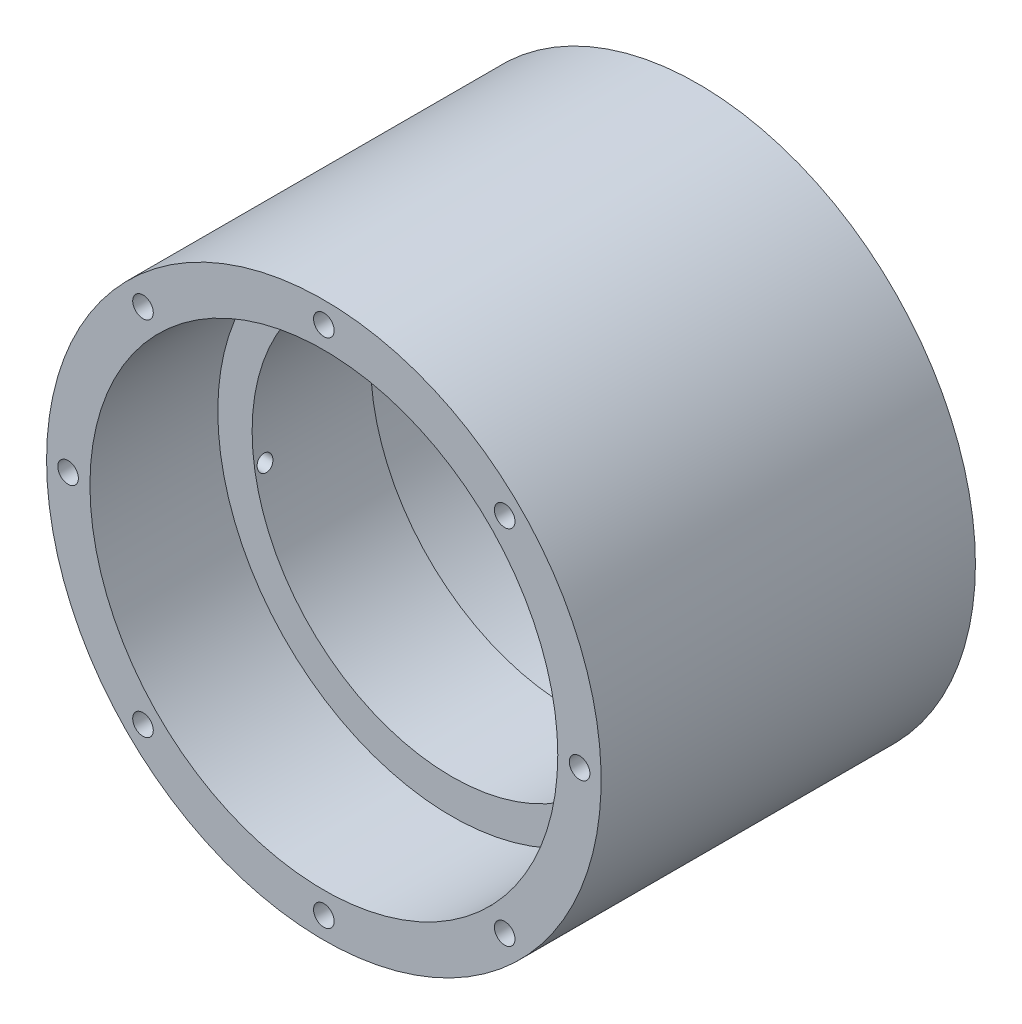
ISO-10303-21;
HEADER;
FILE_DESCRIPTION(('STEP AP214'),'2;1');
FILE_NAME('part.step','',(''),(''),'','','');
FILE_SCHEMA(('AUTOMOTIVE_DESIGN { 1 0 10303 214 1 1 1 1 }'));
ENDSEC;
DATA;
#1=APPLICATION_CONTEXT('core data for automotive mechanical design processes');
#2=APPLICATION_PROTOCOL_DEFINITION('international standard','automotive_design',2000,#1);
#3=PRODUCT_CONTEXT('',#1,'mechanical');
#4=PRODUCT('Part','Part','',(#3));
#5=PRODUCT_RELATED_PRODUCT_CATEGORY('part','',(#4));
#6=PRODUCT_DEFINITION_FORMATION('','',#4);
#7=PRODUCT_DEFINITION_CONTEXT('part definition',#1,'design');
#8=PRODUCT_DEFINITION('design','',#6,#7);
#9=PRODUCT_DEFINITION_SHAPE('','',#8);
#10=(LENGTH_UNIT() NAMED_UNIT(*) SI_UNIT(.MILLI.,.METRE.));
#11=(NAMED_UNIT(*) PLANE_ANGLE_UNIT() SI_UNIT($,.RADIAN.));
#12=(NAMED_UNIT(*) SI_UNIT($,.STERADIAN.) SOLID_ANGLE_UNIT());
#13=UNCERTAINTY_MEASURE_WITH_UNIT(LENGTH_MEASURE(1.E-05),#10,'distance_accuracy_value','');
#14=(GEOMETRIC_REPRESENTATION_CONTEXT(3) GLOBAL_UNCERTAINTY_ASSIGNED_CONTEXT((#13)) GLOBAL_UNIT_ASSIGNED_CONTEXT((#10,
#11,#12)) REPRESENTATION_CONTEXT('',''));
#15=CARTESIAN_POINT('',(0.,0.,0.));
#16=DIRECTION('',(0.,0.,1.));
#17=DIRECTION('',(1.,0.,0.));
#18=AXIS2_PLACEMENT_3D('',#15,#16,#17);
#19=CARTESIAN_POINT('',(0.,0.,60.));
#20=DIRECTION('',(0.,0.,-1.));
#21=DIRECTION('',(-1.,0.,0.));
#22=AXIS2_PLACEMENT_3D('',#19,#20,#21);
#23=CYLINDRICAL_SURFACE('',#22,44.45);
#24=DIRECTION('',(0.,0.,-1.));
#25=VECTOR('',#24,1.);
#26=CARTESIAN_POINT('',(-43.7241637998945,-7.99999999999999,50.));
#27=LINE('',#26,#25);
#28=CARTESIAN_POINT('',(-43.7241637998945,-7.99999999999999,50.));
#29=VERTEX_POINT('',#28);
#30=CARTESIAN_POINT('',(-43.7241637998945,-7.99999999999999,0.));
#31=VERTEX_POINT('',#30);
#32=EDGE_CURVE('E52',#29,#31,#27,.T.);
#33=ORIENTED_EDGE('',*,*,#32,.T.);
#34=CARTESIAN_POINT('',(0.,0.,0.));
#35=DIRECTION('',(0.,0.,-1.));
#36=DIRECTION('',(-1.,0.,0.));
#37=AXIS2_PLACEMENT_3D('',#34,#35,#36);
#38=CIRCLE('',#37,44.45);
#39=CARTESIAN_POINT('',(-43.7241637998945,7.99999999999994,0.));
#40=VERTEX_POINT('',#39);
#41=EDGE_CURVE('E39',#40,#31,#38,.T.);
#42=ORIENTED_EDGE('',*,*,#41,.F.);
#43=DIRECTION('',(0.,0.,-1.));
#44=VECTOR('',#43,1.);
#45=CARTESIAN_POINT('',(-43.7241637998945,7.99999999999998,50.));
#46=LINE('',#45,#44);
#47=CARTESIAN_POINT('',(-43.7241637998945,7.99999999999998,50.));
#48=VERTEX_POINT('',#47);
#49=EDGE_CURVE('E46',#48,#40,#46,.T.);
#50=ORIENTED_EDGE('',*,*,#49,.F.);
#51=CARTESIAN_POINT('',(0.,0.,50.));
#52=DIRECTION('',(0.,0.,-1.));
#53=DIRECTION('',(-1.,0.,0.));
#54=AXIS2_PLACEMENT_3D('',#51,#52,#53);
#55=CIRCLE('',#54,44.45);
#56=EDGE_CURVE('E62',#29,#48,#55,.T.);
#57=ORIENTED_EDGE('',*,*,#56,.F.);
#58=EDGE_LOOP('',(#33,#42,#50,#57));
#59=FACE_BOUND('',#58,.T.);
#60=CARTESIAN_POINT('',(0.,0.,60.));
#61=DIRECTION('',(0.,0.,-1.));
#62=DIRECTION('',(-1.,0.,0.));
#63=AXIS2_PLACEMENT_3D('',#60,#61,#62);
#64=CIRCLE('',#63,44.45);
#65=CARTESIAN_POINT('',(-44.45,0.,60.));
#66=VERTEX_POINT('',#65);
#67=EDGE_CURVE('E11',#66,#66,#64,.T.);
#68=ORIENTED_EDGE('',*,*,#67,.T.);
#69=EDGE_LOOP('',(#68));
#70=FACE_BOUND('',#69,.T.);
#71=ADVANCED_FACE('F32',(#59,#70),#23,.T.);
#72=CARTESIAN_POINT('',(44.45,0.,60.));
#73=DIRECTION('',(0.,0.,1.));
#74=DIRECTION('',(1.,0.,0.));
#75=AXIS2_PLACEMENT_3D('',#72,#73,#74);
#76=PLANE('',#75);
#77=CARTESIAN_POINT('',(28.9913780286488,28.9913780286481,60.));
#78=DIRECTION('',(0.,0.,1.));
#79=DIRECTION('',(1.,0.,0.));
#80=AXIS2_PLACEMENT_3D('',#77,#78,#79);
#81=CIRCLE('',#80,1.64999999999998);
#82=CARTESIAN_POINT('',(30.6413780286488,28.9913780286481,60.));
#83=VERTEX_POINT('',#82);
#84=EDGE_CURVE('E137',#83,#83,#81,.T.);
#85=ORIENTED_EDGE('',*,*,#84,.F.);
#86=EDGE_LOOP('',(#85));
#87=FACE_BOUND('',#86,.T.);
#88=CARTESIAN_POINT('',(4.29452204677705E-13,41.,60.));
#89=DIRECTION('',(0.,0.,1.));
#90=DIRECTION('',(1.,0.,0.));
#91=AXIS2_PLACEMENT_3D('',#88,#89,#90);
#92=CIRCLE('',#91,1.64999999999998);
#93=CARTESIAN_POINT('',(1.65000000000041,41.,60.));
#94=VERTEX_POINT('',#93);
#95=EDGE_CURVE('E131',#94,#94,#92,.T.);
#96=ORIENTED_EDGE('',*,*,#95,.F.);
#97=EDGE_LOOP('',(#96));
#98=FACE_BOUND('',#97,.T.);
#99=CARTESIAN_POINT('',(-28.9913780286482,28.9913780286487,60.));
#100=DIRECTION('',(0.,0.,1.));
#101=DIRECTION('',(1.,0.,0.));
#102=AXIS2_PLACEMENT_3D('',#99,#100,#101);
#103=CIRCLE('',#102,1.64999999999998);
#104=CARTESIAN_POINT('',(-27.3413780286482,28.9913780286487,60.));
#105=VERTEX_POINT('',#104);
#106=EDGE_CURVE('E125',#105,#105,#103,.T.);
#107=ORIENTED_EDGE('',*,*,#106,.F.);
#108=EDGE_LOOP('',(#107));
#109=FACE_BOUND('',#108,.T.);
#110=CARTESIAN_POINT('',(-41.,2.86301469785137E-13,60.));
#111=DIRECTION('',(0.,0.,1.));
#112=DIRECTION('',(1.,0.,0.));
#113=AXIS2_PLACEMENT_3D('',#110,#111,#112);
#114=CIRCLE('',#113,1.64999999999998);
#115=CARTESIAN_POINT('',(-39.35,2.86301469785137E-13,60.));
#116=VERTEX_POINT('',#115);
#117=EDGE_CURVE('E119',#116,#116,#114,.T.);
#118=ORIENTED_EDGE('',*,*,#117,.F.);
#119=EDGE_LOOP('',(#118));
#120=FACE_BOUND('',#119,.T.);
#121=CARTESIAN_POINT('',(-28.9913780286486,-28.9913780286483,60.));
#122=DIRECTION('',(0.,0.,1.));
#123=DIRECTION('',(1.,0.,0.));
#124=AXIS2_PLACEMENT_3D('',#121,#122,#123);
#125=CIRCLE('',#124,1.64999999999998);
#126=CARTESIAN_POINT('',(-27.3413780286486,-28.9913780286483,60.));
#127=VERTEX_POINT('',#126);
#128=EDGE_CURVE('E113',#127,#127,#125,.T.);
#129=ORIENTED_EDGE('',*,*,#128,.F.);
#130=EDGE_LOOP('',(#129));
#131=FACE_BOUND('',#130,.T.);
#132=CARTESIAN_POINT('',(-1.43150734892569E-13,-41.,60.));
#133=DIRECTION('',(0.,0.,1.));
#134=DIRECTION('',(1.,0.,0.));
#135=AXIS2_PLACEMENT_3D('',#132,#133,#134);
#136=CIRCLE('',#135,1.64999999999998);
#137=CARTESIAN_POINT('',(1.64999999999984,-41.,60.));
#138=VERTEX_POINT('',#137);
#139=EDGE_CURVE('E107',#138,#138,#136,.T.);
#140=ORIENTED_EDGE('',*,*,#139,.F.);
#141=EDGE_LOOP('',(#140));
#142=FACE_BOUND('',#141,.T.);
#143=CARTESIAN_POINT('',(28.9913780286484,-28.9913780286485,60.));
#144=DIRECTION('',(0.,0.,1.));
#145=DIRECTION('',(1.,0.,0.));
#146=AXIS2_PLACEMENT_3D('',#143,#144,#145);
#147=CIRCLE('',#146,1.64999999999998);
#148=CARTESIAN_POINT('',(30.6413780286484,-28.9913780286485,60.));
#149=VERTEX_POINT('',#148);
#150=EDGE_CURVE('E101',#149,#149,#147,.T.);
#151=ORIENTED_EDGE('',*,*,#150,.F.);
#152=EDGE_LOOP('',(#151));
#153=FACE_BOUND('',#152,.T.);
#154=CARTESIAN_POINT('',(41.,0.,60.));
#155=DIRECTION('',(0.,0.,1.));
#156=DIRECTION('',(1.,0.,0.));
#157=AXIS2_PLACEMENT_3D('',#154,#155,#156);
#158=CIRCLE('',#157,1.64999999999998);
#159=CARTESIAN_POINT('',(42.65,0.,60.));
#160=VERTEX_POINT('',#159);
#161=EDGE_CURVE('E95',#160,#160,#158,.T.);
#162=ORIENTED_EDGE('',*,*,#161,.F.);
#163=EDGE_LOOP('',(#162));
#164=FACE_BOUND('',#163,.T.);
#165=CARTESIAN_POINT('',(0.,0.,60.));
#166=DIRECTION('',(0.,0.,-1.));
#167=DIRECTION('',(-1.,0.,0.));
#168=AXIS2_PLACEMENT_3D('',#165,#166,#167);
#169=CIRCLE('',#168,37.5);
#170=CARTESIAN_POINT('',(-37.5,0.,60.));
#171=VERTEX_POINT('',#170);
#172=EDGE_CURVE('E63',#171,#171,#169,.T.);
#173=ORIENTED_EDGE('',*,*,#172,.T.);
#174=EDGE_LOOP('',(#173));
#175=FACE_BOUND('',#174,.T.);
#176=ORIENTED_EDGE('',*,*,#67,.F.);
#177=EDGE_LOOP('',(#176));
#178=FACE_BOUND('',#177,.T.);
#179=ADVANCED_FACE('F187',(#87,#98,#109,#120,#131,#142,#153,#164,#175,#178),#76,.T.);
#180=CARTESIAN_POINT('',(0.,0.,0.));
#181=DIRECTION('',(0.,0.,-1.));
#182=DIRECTION('',(-1.,0.,0.));
#183=AXIS2_PLACEMENT_3D('',#180,#181,#182);
#184=PLANE('',#183);
#185=CARTESIAN_POINT('',(0.,0.,0.));
#186=DIRECTION('',(0.,0.,-1.));
#187=DIRECTION('',(-1.,0.,0.));
#188=AXIS2_PLACEMENT_3D('',#185,#186,#187);
#189=CIRCLE('',#188,37.5);
#190=CARTESIAN_POINT('',(-37.5,0.,0.));
#191=VERTEX_POINT('',#190);
#192=EDGE_CURVE('E77',#191,#191,#189,.T.);
#193=ORIENTED_EDGE('',*,*,#192,.F.);
#194=EDGE_LOOP('',(#193));
#195=FACE_BOUND('',#194,.T.);
#196=DIRECTION('',(0.,-1.,0.));
#197=VECTOR('',#196,1.);
#198=CARTESIAN_POINT('',(-43.7241637998945,7.99999999999998,0.));
#199=LINE('',#198,#197);
#200=EDGE_CURVE('E57',#40,#31,#199,.T.);
#201=ORIENTED_EDGE('',*,*,#200,.F.);
#202=ORIENTED_EDGE('',*,*,#41,.T.);
#203=EDGE_LOOP('',(#201,#202));
#204=FACE_BOUND('',#203,.T.);
#205=ADVANCED_FACE('F69',(#195,#204),#184,.T.);
#206=CARTESIAN_POINT('',(-43.7241637998945,7.99999999999998,50.));
#207=DIRECTION('',(1.,0.,0.));
#208=DIRECTION('',(0.,1.,0.));
#209=AXIS2_PLACEMENT_3D('',#206,#207,#208);
#210=PLANE('',#209);
#211=CARTESIAN_POINT('',(-43.7241637998945,-5.05000000000007,37.8347480327554));
#212=DIRECTION('',(-1.,0.,0.));
#213=DIRECTION('',(0.,0.,1.));
#214=AXIS2_PLACEMENT_3D('',#211,#212,#213);
#215=CIRCLE('',#214,1.24999999999999);
#216=CARTESIAN_POINT('',(-43.7241637998945,-5.05000000000007,39.0847480327554));
#217=VERTEX_POINT('',#216);
#218=EDGE_CURVE('E168',#217,#217,#215,.T.);
#219=ORIENTED_EDGE('',*,*,#218,.F.);
#220=EDGE_LOOP('',(#219));
#221=FACE_BOUND('',#220,.T.);
#222=CARTESIAN_POINT('',(-43.7241637998945,5.14999999999991,15.5847480327554));
#223=DIRECTION('',(-1.,0.,0.));
#224=DIRECTION('',(0.,0.,1.));
#225=AXIS2_PLACEMENT_3D('',#222,#223,#224);
#226=CIRCLE('',#225,1.24999999999999);
#227=CARTESIAN_POINT('',(-43.7241637998945,5.14999999999991,16.8347480327554));
#228=VERTEX_POINT('',#227);
#229=EDGE_CURVE('E148',#228,#228,#226,.T.);
#230=ORIENTED_EDGE('',*,*,#229,.F.);
#231=EDGE_LOOP('',(#230));
#232=FACE_BOUND('',#231,.T.);
#233=ORIENTED_EDGE('',*,*,#200,.T.);
#234=ORIENTED_EDGE('',*,*,#32,.F.);
#235=DIRECTION('',(0.,-1.,0.));
#236=VECTOR('',#235,1.);
#237=CARTESIAN_POINT('',(-43.7241637998945,7.99999999999998,50.));
#238=LINE('',#237,#236);
#239=EDGE_CURVE('E71',#48,#29,#238,.T.);
#240=ORIENTED_EDGE('',*,*,#239,.F.);
#241=ORIENTED_EDGE('',*,*,#49,.T.);
#242=EDGE_LOOP('',(#233,#234,#240,#241));
#243=FACE_BOUND('',#242,.T.);
#244=ADVANCED_FACE('F58',(#221,#232,#243),#210,.F.);
#245=CARTESIAN_POINT('',(0.,0.,50.));
#246=DIRECTION('',(0.,0.,-1.));
#247=DIRECTION('',(-1.,0.,0.));
#248=AXIS2_PLACEMENT_3D('',#245,#246,#247);
#249=PLANE('',#248);
#250=ORIENTED_EDGE('',*,*,#56,.T.);
#251=ORIENTED_EDGE('',*,*,#239,.T.);
#252=EDGE_LOOP('',(#250,#251));
#253=FACE_BOUND('',#252,.T.);
#254=ADVANCED_FACE('F175',(#253),#249,.T.);
#255=CARTESIAN_POINT('',(0.,0.,60.));
#256=DIRECTION('',(0.,0.,-1.));
#257=DIRECTION('',(-1.,0.,0.));
#258=AXIS2_PLACEMENT_3D('',#255,#256,#257);
#259=CYLINDRICAL_SURFACE('',#258,37.5);
#260=ORIENTED_EDGE('',*,*,#172,.F.);
#261=EDGE_LOOP('',(#260));
#262=FACE_BOUND('',#261,.T.);
#263=CARTESIAN_POINT('',(0.,0.,39.5));
#264=DIRECTION('',(0.,0.,-1.));
#265=DIRECTION('',(-1.,0.,0.));
#266=AXIS2_PLACEMENT_3D('',#263,#264,#265);
#267=CIRCLE('',#266,37.5);
#268=CARTESIAN_POINT('',(-37.5,0.,39.5));
#269=VERTEX_POINT('',#268);
#270=EDGE_CURVE('E89',#269,#269,#267,.T.);
#271=ORIENTED_EDGE('',*,*,#270,.T.);
#272=EDGE_LOOP('',(#271));
#273=FACE_BOUND('',#272,.T.);
#274=ADVANCED_FACE('F184',(#262,#273),#259,.F.);
#275=CARTESIAN_POINT('',(0.,0.,60.));
#276=DIRECTION('',(0.,0.,-1.));
#277=DIRECTION('',(-1.,0.,0.));
#278=AXIS2_PLACEMENT_3D('',#275,#276,#277);
#279=CYLINDRICAL_SURFACE('',#278,37.5);
#280=CARTESIAN_POINT('',(-37.144683334227,5.14999999999991,16.8347480327554));
#281=CARTESIAN_POINT('',(-37.1348528911148,5.22090051073942,16.8347449450375));
#282=CARTESIAN_POINT('',(-37.1248106513063,5.29182459819324,16.8286963232049));
#283=CARTESIAN_POINT('',(-37.1046086195653,5.43166899050378,16.8046693009774));
#284=CARTESIAN_POINT('',(-37.0944486964647,5.50058668172742,16.7866760082665));
#285=CARTESIAN_POINT('',(-37.0743616385239,5.63438406331942,16.7392631093398));
#286=CARTESIAN_POINT('',(-37.0644344074721,5.69926544161951,16.7098483172179));
#287=CARTESIAN_POINT('',(-37.0451732269609,5.82314994177625,16.6404046422333));
#288=CARTESIAN_POINT('',(-37.0358391210029,5.88215461657673,16.6003785737378));
#289=CARTESIAN_POINT('',(-37.0181484620944,5.99247897915528,16.510902512055));
#290=CARTESIAN_POINT('',(-37.0097898163284,6.04381518822893,16.4614733158417));
#291=CARTESIAN_POINT('',(-36.994379464664,6.13743799182848,16.3544997378289));
#292=CARTESIAN_POINT('',(-36.9873277433184,6.17972469331536,16.2969554519593));
#293=CARTESIAN_POINT('',(-36.9749153479508,6.25356115348532,16.1760328728788));
#294=CARTESIAN_POINT('',(-36.9695374310235,6.28522067548756,16.1127233902448));
#295=CARTESIAN_POINT('',(-36.9606212604343,6.33744290485986,15.9815612417574));
#296=CARTESIAN_POINT('',(-36.9570828495687,6.35800656048572,15.9137089646897));
#297=CARTESIAN_POINT('',(-36.9520492466531,6.38719617492573,15.7763487578726));
#298=CARTESIAN_POINT('',(-36.9505277219078,6.39597600407855,15.7068744677431));
#299=CARTESIAN_POINT('',(-36.9495145861352,6.40182641977568,15.5674216524102));
#300=CARTESIAN_POINT('',(-36.9500228646396,6.39889764353856,15.4974431548543));
#301=CARTESIAN_POINT('',(-36.9530336945292,6.38148698474805,15.3594951754045));
#302=CARTESIAN_POINT('',(-36.9555219470029,6.36708793701472,15.2915148995373));
#303=CARTESIAN_POINT('',(-36.9623580246327,6.3272817010028,15.1589581923875));
#304=CARTESIAN_POINT('',(-36.9667058695097,6.30187439598112,15.0943817972114));
#305=CARTESIAN_POINT('',(-36.9770827601659,6.24069803024955,14.970184866816));
#306=CARTESIAN_POINT('',(-36.983118082518,6.20489026534491,14.9105839338025));
#307=CARTESIAN_POINT('',(-36.9965981456411,6.12400209385604,14.798228800226));
#308=CARTESIAN_POINT('',(-37.0040429693984,6.07892114128647,14.745475003106));
#309=CARTESIAN_POINT('',(-37.0201292159303,5.98018050394595,14.6476308799104));
#310=CARTESIAN_POINT('',(-37.0287839028091,5.92642453564731,14.6026399100731));
#311=CARTESIAN_POINT('',(-37.0468765562931,5.81225203153841,14.522300033647));
#312=CARTESIAN_POINT('',(-37.0563145776811,5.75183502978858,14.4869518021697));
#313=CARTESIAN_POINT('',(-37.0757453062318,5.62523391871104,14.4264584466028));
#314=CARTESIAN_POINT('',(-37.0857434329323,5.55898768513162,14.4014450215018));
#315=CARTESIAN_POINT('',(-37.105837369471,5.42324059699343,14.3629388696798));
#316=CARTESIAN_POINT('',(-37.1159331832372,5.35373961112239,14.3494466082008));
#317=CARTESIAN_POINT('',(-37.1359611780551,5.21300936433585,14.3343211631203));
#318=CARTESIAN_POINT('',(-37.1458920406966,5.14177232097843,14.3327584832582));
#319=CARTESIAN_POINT('',(-37.1652413669283,4.99999535897765,14.3417501007413));
#320=CARTESIAN_POINT('',(-37.1746598327812,4.9294554372568,14.3523043445714));
#321=CARTESIAN_POINT('',(-37.1927245810604,4.79125109340386,14.3852338469232));
#322=CARTESIAN_POINT('',(-37.2013725018675,4.72358073868491,14.4075832890255));
#323=CARTESIAN_POINT('',(-37.2177300857738,4.59291914330473,14.4634942945913));
#324=CARTESIAN_POINT('',(-37.2254397815039,4.52992773994223,14.4970554679657));
#325=CARTESIAN_POINT('',(-37.2397305630399,4.41090027827992,14.5741909051058));
#326=CARTESIAN_POINT('',(-37.2463192036033,4.35481842717962,14.617693101265));
#327=CARTESIAN_POINT('',(-37.2583397294966,4.25074937895236,14.713624643073));
#328=CARTESIAN_POINT('',(-37.2637716609072,4.20276185938029,14.7660536329475));
#329=CARTESIAN_POINT('',(-37.2733846739309,4.1166326816723,14.877925374925));
#330=CARTESIAN_POINT('',(-37.2775748230358,4.07841994392651,14.9373126302776));
#331=CARTESIAN_POINT('',(-37.2847278907407,4.0125017603857,15.0617249423557));
#332=CARTESIAN_POINT('',(-37.2876908482523,3.98479598144007,15.1267498202451));
#333=CARTESIAN_POINT('',(-37.2923630418455,3.94083091658892,15.260216685987));
#334=CARTESIAN_POINT('',(-37.294078885748,3.92451131982482,15.3286385808647));
#335=CARTESIAN_POINT('',(-37.2962777184731,3.90356006865423,15.4672682188042));
#336=CARTESIAN_POINT('',(-37.2967607269552,3.89892822786913,15.5374759333703));
#337=CARTESIAN_POINT('',(-37.2964933123858,3.90148533965298,15.6774920819659));
#338=CARTESIAN_POINT('',(-37.2957460548888,3.90864395463081,15.7473010783946));
#339=CARTESIAN_POINT('',(-37.2930256755793,3.93451432165206,15.8847193049675));
#340=CARTESIAN_POINT('',(-37.2910525577753,3.95322603591851,15.9523285423038));
#341=CARTESIAN_POINT('',(-37.285886575909,4.00165607824829,16.0834365931672));
#342=CARTESIAN_POINT('',(-37.282693640832,4.03137504712507,16.1469351671293));
#343=CARTESIAN_POINT('',(-37.2751046064624,4.10095060576332,16.2680278489174));
#344=CARTESIAN_POINT('',(-37.2707085462307,4.14080686640329,16.3256221483487));
#345=CARTESIAN_POINT('',(-37.2607349755815,4.22961286855187,16.433439906076));
#346=CARTESIAN_POINT('',(-37.2551544982269,4.27858540752631,16.4836443077821));
#347=CARTESIAN_POINT('',(-37.2428785516507,4.3841550189487,16.5751323321814));
#348=CARTESIAN_POINT('',(-37.2361827842689,4.44075412949945,16.6164135625664));
#349=CARTESIAN_POINT('',(-37.221733265501,4.56028678918127,16.6891315414998));
#350=CARTESIAN_POINT('',(-37.2139735623147,4.62325540998598,16.7205093741549));
#351=CARTESIAN_POINT('',(-37.197572847733,4.75340502453666,16.7722266841077));
#352=CARTESIAN_POINT('',(-37.1889328518474,4.82058113078725,16.792578713305));
#353=CARTESIAN_POINT('',(-37.1743078287966,4.93180720303172,16.8163415002608));
#354=CARTESIAN_POINT('',(-37.1685297672093,4.97517127671192,16.8232375260162));
#355=CARTESIAN_POINT('',(-37.1567558924915,5.0623538965539,16.8324417518367));
#356=CARTESIAN_POINT('',(-37.1507600788648,5.1061724437512,16.8347499414459));
#357=CARTESIAN_POINT('',(-37.144683334227,5.14999999999991,16.8347480327554));
#358=B_SPLINE_CURVE_WITH_KNOTS('',3,(#280,#281,#282,#283,#284,#285,#286,#287,#288,#289,#290,
#291,#292,#293,#294,#295,#296,#297,#298,#299,#300,#301,#302,#303,#304,#305,#306,#307,#308,#309,
#310,#311,#312,#313,#314,#315,#316,#317,#318,#319,#320,#321,#322,#323,#324,#325,#326,#327,#328,
#329,#330,#331,#332,#333,#334,#335,#336,#337,#338,#339,#340,#341,#342,#343,#344,#345,#346,#347,
#348,#349,#350,#351,#352,#353,#354,#355,#356,#357),.UNSPECIFIED.,.T.,.F.,(4,2,2,2,2,2,2,2,2,2,2,
2,2,2,2,2,2,2,2,2,2,2,2,2,2,2,2,2,2,2,2,2,2,2,2,2,2,2,4),(0.,0.214574812460327,
0.429417655127943,0.644170040946635,0.858865526122726,1.07309157499613,1.28731509167714,
1.49925252902309,1.71117185126716,1.92029614915831,2.12940906601248,2.33702537581528,
2.54464388745263,2.75304515124104,2.96145868876162,3.17236847438735,3.38329302253361,
3.59682818625758,3.81037197244642,4.02517683103878,4.23998074093472,4.45431644257557,
4.66864468762418,4.88146585846975,5.09427854938609,5.30549666204981,5.51670807693056,
5.72679206547084,5.9368727038889,6.1464136354944,6.35595388193475,6.56550632917573,
6.77505197386892,6.98512885488301,7.19526198798583,7.40662262819543,7.61774214472134,
7.7503824900707,7.88302313771301),.UNSPECIFIED.);
#359=CARTESIAN_POINT('',(-37.144683334227,5.14999999999991,16.8347480327554));
#360=VERTEX_POINT('',#359);
#361=EDGE_CURVE('E140',#360,#360,#358,.T.);
#362=ORIENTED_EDGE('',*,*,#361,.T.);
#363=EDGE_LOOP('',(#362));
#364=FACE_BOUND('',#363,.T.);
#365=CARTESIAN_POINT('',(0.,0.,20.5));
#366=DIRECTION('',(0.,0.,-1.));
#367=DIRECTION('',(-1.,0.,0.));
#368=AXIS2_PLACEMENT_3D('',#365,#366,#367);
#369=CIRCLE('',#368,37.5);
#370=CARTESIAN_POINT('',(-37.5,0.,20.5));
#371=VERTEX_POINT('',#370);
#372=EDGE_CURVE('E80',#371,#371,#369,.T.);
#373=ORIENTED_EDGE('',*,*,#372,.F.);
#374=EDGE_LOOP('',(#373));
#375=FACE_BOUND('',#374,.T.);
#376=ORIENTED_EDGE('',*,*,#192,.T.);
#377=EDGE_LOOP('',(#376));
#378=FACE_BOUND('',#377,.T.);
#379=ADVANCED_FACE('F219',(#364,#375,#378),#279,.F.);
#380=CARTESIAN_POINT('',(37.5,0.,20.5));
#381=DIRECTION('',(0.,0.,1.));
#382=DIRECTION('',(1.,0.,0.));
#383=AXIS2_PLACEMENT_3D('',#380,#381,#382);
#384=PLANE('',#383);
#385=CARTESIAN_POINT('',(0.,0.,20.5));
#386=DIRECTION('',(0.,0.,-1.));
#387=DIRECTION('',(-1.,0.,0.));
#388=AXIS2_PLACEMENT_3D('',#385,#386,#387);
#389=CIRCLE('',#388,32.);
#390=CARTESIAN_POINT('',(-32.,0.,20.5));
#391=VERTEX_POINT('',#390);
#392=EDGE_CURVE('E83',#391,#391,#389,.T.);
#393=ORIENTED_EDGE('',*,*,#392,.F.);
#394=EDGE_LOOP('',(#393));
#395=FACE_BOUND('',#394,.T.);
#396=ORIENTED_EDGE('',*,*,#372,.T.);
#397=EDGE_LOOP('',(#396));
#398=FACE_BOUND('',#397,.T.);
#399=ADVANCED_FACE('F233',(#395,#398),#384,.F.);
#400=CARTESIAN_POINT('',(0.,0.,60.));
#401=DIRECTION('',(0.,0.,-1.));
#402=DIRECTION('',(-1.,0.,0.));
#403=AXIS2_PLACEMENT_3D('',#400,#401,#402);
#404=CYLINDRICAL_SURFACE('',#403,32.);
#405=CARTESIAN_POINT('',(-31.5990110604746,-5.05000000000007,39.0847480327554));
#406=CARTESIAN_POINT('',(-31.6102891033159,-4.97942858720738,39.0847450608575));
#407=CARTESIAN_POINT('',(-31.6213366783599,-4.90877038482601,39.0787530651163));
#408=CARTESIAN_POINT('',(-31.6426713540702,-4.76931246784278,39.0548829999618));
#409=CARTESIAN_POINT('',(-31.6529575908903,-4.70051491890359,39.0369916520221));
#410=CARTESIAN_POINT('',(-31.6725244643878,-4.56681061042861,38.9897598570429));
#411=CARTESIAN_POINT('',(-31.6818051551345,-4.50190364177588,38.960420025992));
#412=CARTESIAN_POINT('',(-31.6991778737891,-4.37790436767826,38.8910777595899));
#413=CARTESIAN_POINT('',(-31.7072702117634,-4.31881054679376,38.8510781133037));
#414=CARTESIAN_POINT('',(-31.722087434473,-4.20859167579249,38.7618521571332));
#415=CARTESIAN_POINT('',(-31.728821994585,-4.15741089639364,38.7126963098968));
#416=CARTESIAN_POINT('',(-31.7409188447558,-4.06402436722578,38.6063434898743));
#417=CARTESIAN_POINT('',(-31.7462811485182,-4.02181852783235,38.5491465973963));
#418=CARTESIAN_POINT('',(-31.7555456181635,-3.94799936908926,38.4289076926337));
#419=CARTESIAN_POINT('',(-31.7594607788446,-3.91629205986199,38.3659243746026));
#420=CARTESIAN_POINT('',(-31.7658792481159,-3.86388624562626,38.235466162245));
#421=CARTESIAN_POINT('',(-31.7683826098751,-3.84318732603793,38.1679914371741));
#422=CARTESIAN_POINT('',(-31.7719593765968,-3.81350518594546,38.0308898226099));
#423=CARTESIAN_POINT('',(-31.7730410413861,-3.80445429874435,37.9612777909705));
#424=CARTESIAN_POINT('',(-31.7737995783917,-3.7981141654517,37.8215131287053));
#425=CARTESIAN_POINT('',(-31.7734764776757,-3.80082469273531,37.7513605085219));
#426=CARTESIAN_POINT('',(-31.7714283201624,-3.81790710734191,37.6126717390764));
#427=CARTESIAN_POINT('',(-31.7697064129067,-3.83225279691034,37.5441323139243));
#428=CARTESIAN_POINT('',(-31.7648685060241,-3.87214788568633,37.4104484346043));
#429=CARTESIAN_POINT('',(-31.7617525086584,-3.89769726672187,37.34530397493));
#430=CARTESIAN_POINT('',(-31.7541345343057,-3.95928008695441,37.2201769576665));
#431=CARTESIAN_POINT('',(-31.7496310724579,-3.99532475590018,37.1602000187676));
#432=CARTESIAN_POINT('',(-31.7392682252595,-4.0768289820651,37.0471607802378));
#433=CARTESIAN_POINT('',(-31.733408820624,-4.12228867318841,36.9940985789686));
#434=CARTESIAN_POINT('',(-31.7203600243388,-4.22152456574871,36.8961256809254));
#435=CARTESIAN_POINT('',(-31.7131647446278,-4.27533740571379,36.8512528875535));
#436=CARTESIAN_POINT('',(-31.6975551512946,-4.38956895748419,36.7711705720993));
#437=CARTESIAN_POINT('',(-31.6891407933419,-4.44998790949477,36.7359614015601));
#438=CARTESIAN_POINT('',(-31.6711594588842,-4.57621572932684,36.6758894999452));
#439=CARTESIAN_POINT('',(-31.6615837440788,-4.64206409235134,36.6511123929175));
#440=CARTESIAN_POINT('',(-31.6415287335983,-4.77685042253994,36.6129476285321));
#441=CARTESIAN_POINT('',(-31.6310493872883,-4.84578856273535,36.5995606098744));
#442=CARTESIAN_POINT('',(-31.609325115038,-4.98554060871946,36.5844140839569));
#443=CARTESIAN_POINT('',(-31.5980734734273,-5.05636647246416,36.5827745060373));
#444=CARTESIAN_POINT('',(-31.5752108488912,-5.19722548019936,36.5914441175516));
#445=CARTESIAN_POINT('',(-31.5635998453115,-5.26725857830859,36.6017539950256));
#446=CARTESIAN_POINT('',(-31.5402806677472,-5.4051481109854,36.6341539980978));
#447=CARTESIAN_POINT('',(-31.5285724713679,-5.47298221490968,36.6563392345689));
#448=CARTESIAN_POINT('',(-31.505556714952,-5.60395588744305,36.7119415119903));
#449=CARTESIAN_POINT('',(-31.4942491635228,-5.66709535522659,36.7453587940836));
#450=CARTESIAN_POINT('',(-31.4724600537168,-5.7868790795586,36.8225299746293));
#451=CARTESIAN_POINT('',(-31.4619785808262,-5.84352266416094,36.8662849410008));
#452=CARTESIAN_POINT('',(-31.4422734825977,-5.94863881470916,36.9629422502653));
#453=CARTESIAN_POINT('',(-31.433049793713,-5.9971117934869,37.0158441307232));
#454=CARTESIAN_POINT('',(-31.4163623768435,-6.08392251317164,37.1286917037353));
#455=CARTESIAN_POINT('',(-31.4088802354395,-6.12236686618559,37.1885526163383));
#456=CARTESIAN_POINT('',(-31.3958935952915,-6.18861944999391,37.3140931974283));
#457=CARTESIAN_POINT('',(-31.3903888793575,-6.21642884889723,37.3797722258956));
#458=CARTESIAN_POINT('',(-31.3817042582696,-6.26012208309218,37.5138325814496));
#459=CARTESIAN_POINT('',(-31.3784847912082,-6.27620899388857,37.5821451768007));
#460=CARTESIAN_POINT('',(-31.3743716959006,-6.29673826280625,37.7205650304702));
#461=CARTESIAN_POINT('',(-31.3734778592658,-6.30118166424754,37.7906721274232));
#462=CARTESIAN_POINT('',(-31.3740562876324,-6.29830080588364,37.9296985415372));
#463=CARTESIAN_POINT('',(-31.3754972964885,-6.29113199695902,37.9986212707544));
#464=CARTESIAN_POINT('',(-31.3806162831636,-6.26554783436723,38.1342582281655));
#465=CARTESIAN_POINT('',(-31.3842942360331,-6.24713260613572,38.2009724809826));
#466=CARTESIAN_POINT('',(-31.3937139314897,-6.19962160994403,38.3303499302796));
#467=CARTESIAN_POINT('',(-31.3994564146972,-6.17052200904079,38.3930116634468));
#468=CARTESIAN_POINT('',(-31.4127425869514,-6.10252392848839,38.5125553358801));
#469=CARTESIAN_POINT('',(-31.4202863180386,-6.06362522013086,38.5694371402008));
#470=CARTESIAN_POINT('',(-31.4369607266685,-5.97657802420914,38.6766413739151));
#471=CARTESIAN_POINT('',(-31.4461113125776,-5.92831258708006,38.7268657066191));
#472=CARTESIAN_POINT('',(-31.465552072119,-5.82424501402477,38.8185443696361));
#473=CARTESIAN_POINT('',(-31.4758426247834,-5.76844036999579,38.8599957695885));
#474=CARTESIAN_POINT('',(-31.4973575872857,-5.64979312328791,38.9337088700856));
#475=CARTESIAN_POINT('',(-31.5085954842139,-5.58684181270976,38.9657915019498));
#476=CARTESIAN_POINT('',(-31.5314201033916,-5.45654692219903,39.0188757689499));
#477=CARTESIAN_POINT('',(-31.5430064337641,-5.38920818407186,39.039889394269));
#478=CARTESIAN_POINT('',(-31.5620549458802,-5.27624155277635,39.0649456578556));
#479=CARTESIAN_POINT('',(-31.5695300613221,-5.23133520131989,39.0723601082684));
#480=CARTESIAN_POINT('',(-31.5843724065202,-5.14096459584863,39.082262276057));
#481=CARTESIAN_POINT('',(-31.5917396352997,-5.09550033679039,39.0847499488621));
#482=CARTESIAN_POINT('',(-31.5990110604746,-5.05000000000007,39.0847480327554));
#483=B_SPLINE_CURVE_WITH_KNOTS('',3,(#405,#406,#407,#408,#409,#410,#411,#412,#413,#414,#415,
#416,#417,#418,#419,#420,#421,#422,#423,#424,#425,#426,#427,#428,#429,#430,#431,#432,#433,#434,
#435,#436,#437,#438,#439,#440,#441,#442,#443,#444,#445,#446,#447,#448,#449,#450,#451,#452,#453,
#454,#455,#456,#457,#458,#459,#460,#461,#462,#463,#464,#465,#466,#467,#468,#469,#470,#471,#472,
#473,#474,#475,#476,#477,#478,#479,#480,#481,#482),.UNSPECIFIED.,.T.,.F.,(4,2,2,2,2,2,2,2,2,2,2,
2,2,2,2,2,2,2,2,2,2,2,2,2,2,2,2,2,2,2,2,2,2,2,2,2,2,2,4),(0.,0.214234628204967,
0.428708723549192,0.643171280651084,0.857577780143764,1.0703977816709,1.28321565786225,
1.49407320299883,1.70492280660286,1.91454191287912,2.124156980127,2.33330138361533,
2.54244544787962,2.75181411965184,2.96118576935257,3.17150316081169,3.38182820217962,
3.59384739249409,3.80587847101542,4.02007112515877,4.23427611295918,4.45022293605879,
4.66617439565587,4.8821481735586,5.0981110357957,5.31167472382463,5.52521494796715,
5.73496173973722,5.94468973644323,6.15163326600327,6.35857448748431,6.56559002031548,
6.77261038527797,6.98240449965126,7.19226857985572,7.40591461079638,7.61932873742055,
7.7574534988043,7.89557950974457),.UNSPECIFIED.);
#484=CARTESIAN_POINT('',(-31.5990110604746,-5.05000000000007,39.0847480327554));
#485=VERTEX_POINT('',#484);
#486=EDGE_CURVE('E162',#485,#485,#483,.T.);
#487=ORIENTED_EDGE('',*,*,#486,.T.);
#488=EDGE_LOOP('',(#487));
#489=FACE_BOUND('',#488,.T.);
#490=CARTESIAN_POINT('',(0.,0.,39.5));
#491=DIRECTION('',(0.,0.,-1.));
#492=DIRECTION('',(-1.,0.,0.));
#493=AXIS2_PLACEMENT_3D('',#490,#491,#492);
#494=CIRCLE('',#493,32.);
#495=CARTESIAN_POINT('',(-32.,0.,39.5));
#496=VERTEX_POINT('',#495);
#497=EDGE_CURVE('E86',#496,#496,#494,.T.);
#498=ORIENTED_EDGE('',*,*,#497,.F.);
#499=EDGE_LOOP('',(#498));
#500=FACE_BOUND('',#499,.T.);
#501=ORIENTED_EDGE('',*,*,#392,.T.);
#502=EDGE_LOOP('',(#501));
#503=FACE_BOUND('',#502,.T.);
#504=ADVANCED_FACE('F227',(#489,#500,#503),#404,.F.);
#505=CARTESIAN_POINT('',(32.,0.,39.5));
#506=DIRECTION('',(0.,0.,-1.));
#507=DIRECTION('',(-1.,0.,0.));
#508=AXIS2_PLACEMENT_3D('',#505,#506,#507);
#509=PLANE('',#508);
#510=ORIENTED_EDGE('',*,*,#270,.F.);
#511=EDGE_LOOP('',(#510));
#512=FACE_BOUND('',#511,.T.);
#513=ORIENTED_EDGE('',*,*,#497,.T.);
#514=EDGE_LOOP('',(#513));
#515=FACE_BOUND('',#514,.T.);
#516=ADVANCED_FACE('F223',(#512,#515),#509,.F.);
#517=CARTESIAN_POINT('',(41.,0.,52.));
#518=DIRECTION('',(0.,0.,-1.));
#519=DIRECTION('',(-1.,0.,0.));
#520=AXIS2_PLACEMENT_3D('',#517,#518,#519);
#521=PLANE('',#520);
#522=CARTESIAN_POINT('',(41.,0.,52.));
#523=DIRECTION('',(0.,0.,1.));
#524=DIRECTION('',(1.,0.,0.));
#525=AXIS2_PLACEMENT_3D('',#522,#523,#524);
#526=CIRCLE('',#525,1.64999999999998);
#527=CARTESIAN_POINT('',(42.65,0.,52.));
#528=VERTEX_POINT('',#527);
#529=EDGE_CURVE('E92',#528,#528,#526,.T.);
#530=ORIENTED_EDGE('',*,*,#529,.T.);
#531=EDGE_LOOP('',(#530));
#532=FACE_BOUND('',#531,.T.);
#533=ADVANCED_FACE('F226',(#532),#521,.F.);
#534=CARTESIAN_POINT('',(41.,0.,60.));
#535=DIRECTION('',(0.,0.,1.));
#536=DIRECTION('',(1.,0.,0.));
#537=AXIS2_PLACEMENT_3D('',#534,#535,#536);
#538=CYLINDRICAL_SURFACE('',#537,1.64999999999998);
#539=ORIENTED_EDGE('',*,*,#529,.F.);
#540=EDGE_LOOP('',(#539));
#541=FACE_BOUND('',#540,.T.);
#542=ORIENTED_EDGE('',*,*,#161,.T.);
#543=EDGE_LOOP('',(#542));
#544=FACE_BOUND('',#543,.T.);
#545=ADVANCED_FACE('F253',(#541,#544),#538,.F.);
#546=CARTESIAN_POINT('',(28.9913780286484,-28.9913780286485,52.));
#547=DIRECTION('',(0.,0.,-1.));
#548=DIRECTION('',(-1.,0.,0.));
#549=AXIS2_PLACEMENT_3D('',#546,#547,#548);
#550=PLANE('',#549);
#551=CARTESIAN_POINT('',(28.9913780286484,-28.9913780286485,52.));
#552=DIRECTION('',(0.,0.,1.));
#553=DIRECTION('',(1.,0.,0.));
#554=AXIS2_PLACEMENT_3D('',#551,#552,#553);
#555=CIRCLE('',#554,1.64999999999998);
#556=CARTESIAN_POINT('',(30.6413780286484,-28.9913780286485,52.));
#557=VERTEX_POINT('',#556);
#558=EDGE_CURVE('E98',#557,#557,#555,.T.);
#559=ORIENTED_EDGE('',*,*,#558,.T.);
#560=EDGE_LOOP('',(#559));
#561=FACE_BOUND('',#560,.T.);
#562=ADVANCED_FACE('F257',(#561),#550,.F.);
#563=CARTESIAN_POINT('',(28.9913780286484,-28.9913780286485,60.));
#564=DIRECTION('',(0.,0.,1.));
#565=DIRECTION('',(1.,0.,0.));
#566=AXIS2_PLACEMENT_3D('',#563,#564,#565);
#567=CYLINDRICAL_SURFACE('',#566,1.64999999999998);
#568=ORIENTED_EDGE('',*,*,#558,.F.);
#569=EDGE_LOOP('',(#568));
#570=FACE_BOUND('',#569,.T.);
#571=ORIENTED_EDGE('',*,*,#150,.T.);
#572=EDGE_LOOP('',(#571));
#573=FACE_BOUND('',#572,.T.);
#574=ADVANCED_FACE('F261',(#570,#573),#567,.F.);
#575=CARTESIAN_POINT('',(-1.45110169771204E-13,-41.,52.));
#576=DIRECTION('',(0.,0.,-1.));
#577=DIRECTION('',(-1.,0.,0.));
#578=AXIS2_PLACEMENT_3D('',#575,#576,#577);
#579=PLANE('',#578);
#580=CARTESIAN_POINT('',(-1.43150734892569E-13,-41.,52.));
#581=DIRECTION('',(0.,0.,1.));
#582=DIRECTION('',(1.,0.,0.));
#583=AXIS2_PLACEMENT_3D('',#580,#581,#582);
#584=CIRCLE('',#583,1.64999999999998);
#585=CARTESIAN_POINT('',(1.64999999999984,-41.,52.));
#586=VERTEX_POINT('',#585);
#587=EDGE_CURVE('E104',#586,#586,#584,.T.);
#588=ORIENTED_EDGE('',*,*,#587,.T.);
#589=EDGE_LOOP('',(#588));
#590=FACE_BOUND('',#589,.T.);
#591=ADVANCED_FACE('F265',(#590),#579,.F.);
#592=CARTESIAN_POINT('',(-1.43150734892569E-13,-41.,60.));
#593=DIRECTION('',(0.,0.,1.));
#594=DIRECTION('',(1.,0.,0.));
#595=AXIS2_PLACEMENT_3D('',#592,#593,#594);
#596=CYLINDRICAL_SURFACE('',#595,1.64999999999998);
#597=ORIENTED_EDGE('',*,*,#587,.F.);
#598=EDGE_LOOP('',(#597));
#599=FACE_BOUND('',#598,.T.);
#600=ORIENTED_EDGE('',*,*,#139,.T.);
#601=EDGE_LOOP('',(#600));
#602=FACE_BOUND('',#601,.T.);
#603=ADVANCED_FACE('F269',(#599,#602),#596,.F.);
#604=CARTESIAN_POINT('',(-28.9913780286486,-28.9913780286483,52.));
#605=DIRECTION('',(0.,0.,-1.));
#606=DIRECTION('',(-1.,0.,0.));
#607=AXIS2_PLACEMENT_3D('',#604,#605,#606);
#608=PLANE('',#607);
#609=CARTESIAN_POINT('',(-28.9913780286486,-28.9913780286483,52.));
#610=DIRECTION('',(0.,0.,1.));
#611=DIRECTION('',(1.,0.,0.));
#612=AXIS2_PLACEMENT_3D('',#609,#610,#611);
#613=CIRCLE('',#612,1.64999999999998);
#614=CARTESIAN_POINT('',(-27.3413780286486,-28.9913780286483,52.));
#615=VERTEX_POINT('',#614);
#616=EDGE_CURVE('E110',#615,#615,#613,.T.);
#617=ORIENTED_EDGE('',*,*,#616,.T.);
#618=EDGE_LOOP('',(#617));
#619=FACE_BOUND('',#618,.T.);
#620=ADVANCED_FACE('F273',(#619),#608,.F.);
#621=CARTESIAN_POINT('',(-28.9913780286486,-28.9913780286483,60.));
#622=DIRECTION('',(0.,0.,1.));
#623=DIRECTION('',(1.,0.,0.));
#624=AXIS2_PLACEMENT_3D('',#621,#622,#623);
#625=CYLINDRICAL_SURFACE('',#624,1.64999999999998);
#626=ORIENTED_EDGE('',*,*,#616,.F.);
#627=EDGE_LOOP('',(#626));
#628=FACE_BOUND('',#627,.T.);
#629=ORIENTED_EDGE('',*,*,#128,.T.);
#630=EDGE_LOOP('',(#629));
#631=FACE_BOUND('',#630,.T.);
#632=ADVANCED_FACE('F277',(#628,#631),#625,.F.);
#633=CARTESIAN_POINT('',(-41.,2.86301469785137E-13,52.));
#634=DIRECTION('',(0.,0.,-1.));
#635=DIRECTION('',(-1.,0.,0.));
#636=AXIS2_PLACEMENT_3D('',#633,#634,#635);
#637=PLANE('',#636);
#638=CARTESIAN_POINT('',(-41.,2.86301469785137E-13,52.));
#639=DIRECTION('',(0.,0.,1.));
#640=DIRECTION('',(1.,0.,0.));
#641=AXIS2_PLACEMENT_3D('',#638,#639,#640);
#642=CIRCLE('',#641,1.64999999999998);
#643=CARTESIAN_POINT('',(-39.35,2.86301469785137E-13,52.));
#644=VERTEX_POINT('',#643);
#645=EDGE_CURVE('E116',#644,#644,#642,.T.);
#646=ORIENTED_EDGE('',*,*,#645,.T.);
#647=EDGE_LOOP('',(#646));
#648=FACE_BOUND('',#647,.T.);
#649=ADVANCED_FACE('F281',(#648),#637,.F.);
#650=CARTESIAN_POINT('',(-41.,2.86301469785137E-13,60.));
#651=DIRECTION('',(0.,0.,1.));
#652=DIRECTION('',(1.,0.,0.));
#653=AXIS2_PLACEMENT_3D('',#650,#651,#652);
#654=CYLINDRICAL_SURFACE('',#653,1.64999999999998);
#655=ORIENTED_EDGE('',*,*,#645,.F.);
#656=EDGE_LOOP('',(#655));
#657=FACE_BOUND('',#656,.T.);
#658=ORIENTED_EDGE('',*,*,#117,.T.);
#659=EDGE_LOOP('',(#658));
#660=FACE_BOUND('',#659,.T.);
#661=ADVANCED_FACE('F285',(#657,#660),#654,.F.);
#662=CARTESIAN_POINT('',(-28.9913780286482,28.9913780286487,52.));
#663=DIRECTION('',(0.,0.,-1.));
#664=DIRECTION('',(-1.,0.,0.));
#665=AXIS2_PLACEMENT_3D('',#662,#663,#664);
#666=PLANE('',#665);
#667=CARTESIAN_POINT('',(-28.9913780286482,28.9913780286487,52.));
#668=DIRECTION('',(0.,0.,1.));
#669=DIRECTION('',(1.,0.,0.));
#670=AXIS2_PLACEMENT_3D('',#667,#668,#669);
#671=CIRCLE('',#670,1.64999999999998);
#672=CARTESIAN_POINT('',(-27.3413780286482,28.9913780286487,52.));
#673=VERTEX_POINT('',#672);
#674=EDGE_CURVE('E122',#673,#673,#671,.T.);
#675=ORIENTED_EDGE('',*,*,#674,.T.);
#676=EDGE_LOOP('',(#675));
#677=FACE_BOUND('',#676,.T.);
#678=ADVANCED_FACE('F289',(#677),#666,.F.);
#679=CARTESIAN_POINT('',(-28.9913780286482,28.9913780286487,60.));
#680=DIRECTION('',(0.,0.,1.));
#681=DIRECTION('',(1.,0.,0.));
#682=AXIS2_PLACEMENT_3D('',#679,#680,#681);
#683=CYLINDRICAL_SURFACE('',#682,1.64999999999998);
#684=ORIENTED_EDGE('',*,*,#674,.F.);
#685=EDGE_LOOP('',(#684));
#686=FACE_BOUND('',#685,.T.);
#687=ORIENTED_EDGE('',*,*,#106,.T.);
#688=EDGE_LOOP('',(#687));
#689=FACE_BOUND('',#688,.T.);
#690=ADVANCED_FACE('F293',(#686,#689),#683,.F.);
#691=CARTESIAN_POINT('',(4.2749276979907E-13,41.,52.));
#692=DIRECTION('',(0.,0.,-1.));
#693=DIRECTION('',(-1.,0.,0.));
#694=AXIS2_PLACEMENT_3D('',#691,#692,#693);
#695=PLANE('',#694);
#696=CARTESIAN_POINT('',(4.29452204677705E-13,41.,52.));
#697=DIRECTION('',(0.,0.,1.));
#698=DIRECTION('',(1.,0.,0.));
#699=AXIS2_PLACEMENT_3D('',#696,#697,#698);
#700=CIRCLE('',#699,1.64999999999998);
#701=CARTESIAN_POINT('',(1.65000000000041,41.,52.));
#702=VERTEX_POINT('',#701);
#703=EDGE_CURVE('E128',#702,#702,#700,.T.);
#704=ORIENTED_EDGE('',*,*,#703,.T.);
#705=EDGE_LOOP('',(#704));
#706=FACE_BOUND('',#705,.T.);
#707=ADVANCED_FACE('F297',(#706),#695,.F.);
#708=CARTESIAN_POINT('',(4.29452204677705E-13,41.,60.));
#709=DIRECTION('',(0.,0.,1.));
#710=DIRECTION('',(1.,0.,0.));
#711=AXIS2_PLACEMENT_3D('',#708,#709,#710);
#712=CYLINDRICAL_SURFACE('',#711,1.64999999999998);
#713=ORIENTED_EDGE('',*,*,#703,.F.);
#714=EDGE_LOOP('',(#713));
#715=FACE_BOUND('',#714,.T.);
#716=ORIENTED_EDGE('',*,*,#95,.T.);
#717=EDGE_LOOP('',(#716));
#718=FACE_BOUND('',#717,.T.);
#719=ADVANCED_FACE('F301',(#715,#718),#712,.F.);
#720=CARTESIAN_POINT('',(28.9913780286488,28.9913780286481,52.));
#721=DIRECTION('',(0.,0.,-1.));
#722=DIRECTION('',(-1.,0.,0.));
#723=AXIS2_PLACEMENT_3D('',#720,#721,#722);
#724=PLANE('',#723);
#725=CARTESIAN_POINT('',(28.9913780286488,28.9913780286481,52.));
#726=DIRECTION('',(0.,0.,1.));
#727=DIRECTION('',(1.,0.,0.));
#728=AXIS2_PLACEMENT_3D('',#725,#726,#727);
#729=CIRCLE('',#728,1.64999999999998);
#730=CARTESIAN_POINT('',(30.6413780286488,28.9913780286481,52.));
#731=VERTEX_POINT('',#730);
#732=EDGE_CURVE('E134',#731,#731,#729,.T.);
#733=ORIENTED_EDGE('',*,*,#732,.T.);
#734=EDGE_LOOP('',(#733));
#735=FACE_BOUND('',#734,.T.);
#736=ADVANCED_FACE('F305',(#735),#724,.F.);
#737=CARTESIAN_POINT('',(28.9913780286488,28.9913780286481,60.));
#738=DIRECTION('',(0.,0.,1.));
#739=DIRECTION('',(1.,0.,0.));
#740=AXIS2_PLACEMENT_3D('',#737,#738,#739);
#741=CYLINDRICAL_SURFACE('',#740,1.64999999999998);
#742=ORIENTED_EDGE('',*,*,#732,.F.);
#743=EDGE_LOOP('',(#742));
#744=FACE_BOUND('',#743,.T.);
#745=ORIENTED_EDGE('',*,*,#84,.T.);
#746=EDGE_LOOP('',(#745));
#747=FACE_BOUND('',#746,.T.);
#748=ADVANCED_FACE('F157',(#744,#747),#741,.F.);
#749=CARTESIAN_POINT('',(-43.7241637998945,5.14999999999991,15.5847480327554));
#750=DIRECTION('',(-1.,0.,0.));
#751=DIRECTION('',(0.,0.,1.));
#752=AXIS2_PLACEMENT_3D('',#749,#750,#751);
#753=CYLINDRICAL_SURFACE('',#752,1.24999999999999);
#754=ORIENTED_EDGE('',*,*,#361,.F.);
#755=EDGE_LOOP('',(#754));
#756=FACE_BOUND('',#755,.T.);
#757=ORIENTED_EDGE('',*,*,#229,.T.);
#758=EDGE_LOOP('',(#757));
#759=FACE_BOUND('',#758,.T.);
#760=ADVANCED_FACE('F152',(#756,#759),#753,.F.);
#761=CARTESIAN_POINT('',(-43.7241637998945,-5.05000000000007,37.8347480327554));
#762=DIRECTION('',(-1.,0.,0.));
#763=DIRECTION('',(0.,0.,1.));
#764=AXIS2_PLACEMENT_3D('',#761,#762,#763);
#765=CYLINDRICAL_SURFACE('',#764,1.24999999999999);
#766=ORIENTED_EDGE('',*,*,#486,.F.);
#767=EDGE_LOOP('',(#766));
#768=FACE_BOUND('',#767,.T.);
#769=ORIENTED_EDGE('',*,*,#218,.T.);
#770=EDGE_LOOP('',(#769));
#771=FACE_BOUND('',#770,.T.);
#772=ADVANCED_FACE('F156',(#768,#771),#765,.F.);
#773=CLOSED_SHELL('',(#71,#179,#205,#244,#254,#274,#379,#399,#504,#516,#533,#545,#562,#574,#591,
#603,#620,#632,#649,#661,#678,#690,#707,#719,#736,#748,#760,#772));
#774=MANIFOLD_SOLID_BREP('B2',#773);
#775=ADVANCED_BREP_SHAPE_REPRESENTATION('',(#18,#774),#14);
#776=SHAPE_DEFINITION_REPRESENTATION(#9,#775);
ENDSEC;
END-ISO-10303-21;
